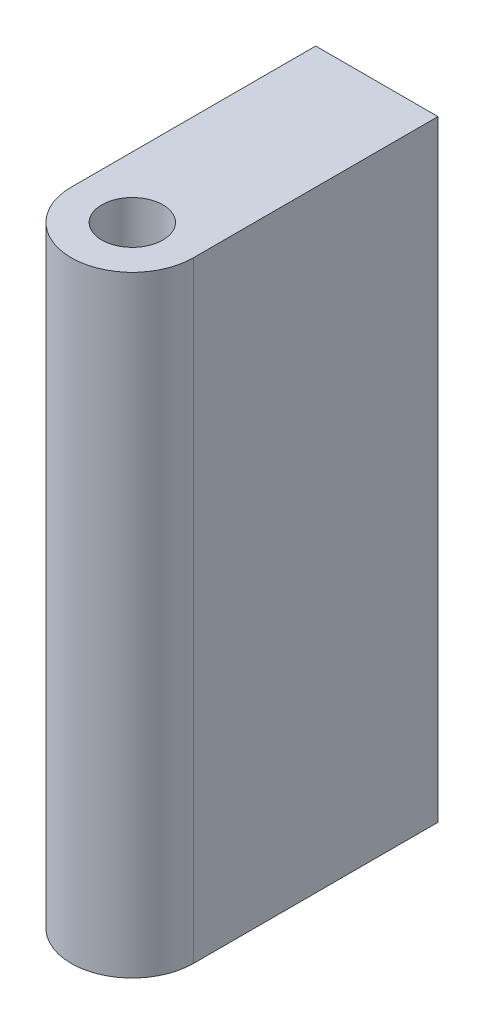
ISO-10303-21;
HEADER;
FILE_DESCRIPTION(('STEP AP214'),'2;1');
FILE_NAME('part.step','',(''),(''),'','','');
FILE_SCHEMA(('AUTOMOTIVE_DESIGN { 1 0 10303 214 1 1 1 1 }'));
ENDSEC;
DATA;
#1=APPLICATION_CONTEXT('core data for automotive mechanical design processes');
#2=APPLICATION_PROTOCOL_DEFINITION('international standard','automotive_design',2000,#1);
#3=PRODUCT_CONTEXT('',#1,'mechanical');
#4=PRODUCT('Part','Part','',(#3));
#5=PRODUCT_RELATED_PRODUCT_CATEGORY('part','',(#4));
#6=PRODUCT_DEFINITION_FORMATION('','',#4);
#7=PRODUCT_DEFINITION_CONTEXT('part definition',#1,'design');
#8=PRODUCT_DEFINITION('design','',#6,#7);
#9=PRODUCT_DEFINITION_SHAPE('','',#8);
#10=(LENGTH_UNIT() NAMED_UNIT(*) SI_UNIT(.MILLI.,.METRE.));
#11=(NAMED_UNIT(*) PLANE_ANGLE_UNIT() SI_UNIT($,.RADIAN.));
#12=(NAMED_UNIT(*) SI_UNIT($,.STERADIAN.) SOLID_ANGLE_UNIT());
#13=UNCERTAINTY_MEASURE_WITH_UNIT(LENGTH_MEASURE(1.E-05),#10,'distance_accuracy_value','');
#14=(GEOMETRIC_REPRESENTATION_CONTEXT(3) GLOBAL_UNCERTAINTY_ASSIGNED_CONTEXT((#13)) GLOBAL_UNIT_ASSIGNED_CONTEXT((#10,
#11,#12)) REPRESENTATION_CONTEXT('',''));
#15=CARTESIAN_POINT('',(0.,0.,0.));
#16=DIRECTION('',(0.,0.,1.));
#17=DIRECTION('',(1.,0.,0.));
#18=AXIS2_PLACEMENT_3D('',#15,#16,#17);
#19=CARTESIAN_POINT('',(0.5,-2.5,0.));
#20=DIRECTION('',(1.,0.,0.));
#21=DIRECTION('',(0.,0.,-1.));
#22=AXIS2_PLACEMENT_3D('',#19,#20,#21);
#23=PLANE('',#22);
#24=DIRECTION('',(0.,1.,0.));
#25=VECTOR('',#24,1.);
#26=CARTESIAN_POINT('',(0.5,-2.5,-2.));
#27=LINE('',#26,#25);
#28=CARTESIAN_POINT('',(0.5,-2.5,-2.));
#29=VERTEX_POINT('',#28);
#30=CARTESIAN_POINT('',(0.5,2.5,-2.));
#31=VERTEX_POINT('',#30);
#32=EDGE_CURVE('E39',#29,#31,#27,.T.);
#33=ORIENTED_EDGE('',*,*,#32,.T.);
#34=DIRECTION('',(0.,0.,-1.));
#35=VECTOR('',#34,1.);
#36=CARTESIAN_POINT('',(0.5,2.5,0.));
#37=LINE('',#36,#35);
#38=CARTESIAN_POINT('',(0.5,2.5,0.));
#39=VERTEX_POINT('',#38);
#40=EDGE_CURVE('E76',#39,#31,#37,.T.);
#41=ORIENTED_EDGE('',*,*,#40,.F.);
#42=DIRECTION('',(0.,1.,0.));
#43=VECTOR('',#42,1.);
#44=CARTESIAN_POINT('',(0.5,-2.5,0.));
#45=LINE('',#44,#43);
#46=CARTESIAN_POINT('',(0.5,-2.5,0.));
#47=VERTEX_POINT('',#46);
#48=EDGE_CURVE('E11',#47,#39,#45,.T.);
#49=ORIENTED_EDGE('',*,*,#48,.F.);
#50=DIRECTION('',(0.,0.,-1.));
#51=VECTOR('',#50,1.);
#52=CARTESIAN_POINT('',(0.5,-2.5,0.));
#53=LINE('',#52,#51);
#54=EDGE_CURVE('E77',#47,#29,#53,.T.);
#55=ORIENTED_EDGE('',*,*,#54,.T.);
#56=EDGE_LOOP('',(#33,#41,#49,#55));
#57=FACE_BOUND('',#56,.T.);
#58=ADVANCED_FACE('F36',(#57),#23,.T.);
#59=CARTESIAN_POINT('',(0.,-2.5,0.));
#60=DIRECTION('',(0.,1.,0.));
#61=DIRECTION('',(0.,0.,1.));
#62=AXIS2_PLACEMENT_3D('',#59,#60,#61);
#63=CYLINDRICAL_SURFACE('',#62,0.5);
#64=ORIENTED_EDGE('',*,*,#48,.T.);
#65=CARTESIAN_POINT('',(0.,2.5,0.));
#66=DIRECTION('',(0.,1.,0.));
#67=DIRECTION('',(0.,0.,1.));
#68=AXIS2_PLACEMENT_3D('',#65,#66,#67);
#69=CIRCLE('',#68,0.5);
#70=CARTESIAN_POINT('',(-0.5,2.5,0.));
#71=VERTEX_POINT('',#70);
#72=EDGE_CURVE('E94',#71,#39,#69,.T.);
#73=ORIENTED_EDGE('',*,*,#72,.F.);
#74=DIRECTION('',(0.,1.,0.));
#75=VECTOR('',#74,1.);
#76=CARTESIAN_POINT('',(-0.5,-2.5,0.));
#77=LINE('',#76,#75);
#78=CARTESIAN_POINT('',(-0.5,-2.5,0.));
#79=VERTEX_POINT('',#78);
#80=EDGE_CURVE('E44',#79,#71,#77,.T.);
#81=ORIENTED_EDGE('',*,*,#80,.F.);
#82=CARTESIAN_POINT('',(0.,-2.5,0.));
#83=DIRECTION('',(0.,1.,0.));
#84=DIRECTION('',(0.,0.,1.));
#85=AXIS2_PLACEMENT_3D('',#82,#83,#84);
#86=CIRCLE('',#85,0.5);
#87=EDGE_CURVE('E82',#79,#47,#86,.T.);
#88=ORIENTED_EDGE('',*,*,#87,.T.);
#89=EDGE_LOOP('',(#64,#73,#81,#88));
#90=FACE_BOUND('',#89,.T.);
#91=ADVANCED_FACE('F115',(#90),#63,.T.);
#92=CARTESIAN_POINT('',(-0.5,-2.5,0.));
#93=DIRECTION('',(-1.,0.,0.));
#94=DIRECTION('',(0.,0.,1.));
#95=AXIS2_PLACEMENT_3D('',#92,#93,#94);
#96=PLANE('',#95);
#97=ORIENTED_EDGE('',*,*,#80,.T.);
#98=DIRECTION('',(0.,0.,1.));
#99=VECTOR('',#98,1.);
#100=CARTESIAN_POINT('',(-0.5,2.5,0.));
#101=LINE('',#100,#99);
#102=CARTESIAN_POINT('',(-0.5,2.5,-2.));
#103=VERTEX_POINT('',#102);
#104=EDGE_CURVE('E89',#103,#71,#101,.T.);
#105=ORIENTED_EDGE('',*,*,#104,.F.);
#106=DIRECTION('',(0.,1.,0.));
#107=VECTOR('',#106,1.);
#108=CARTESIAN_POINT('',(-0.5,-2.5,-2.));
#109=LINE('',#108,#107);
#110=CARTESIAN_POINT('',(-0.5,-2.5,-2.));
#111=VERTEX_POINT('',#110);
#112=EDGE_CURVE('E81',#111,#103,#109,.T.);
#113=ORIENTED_EDGE('',*,*,#112,.F.);
#114=DIRECTION('',(0.,0.,1.));
#115=VECTOR('',#114,1.);
#116=CARTESIAN_POINT('',(-0.5,-2.5,0.));
#117=LINE('',#116,#115);
#118=EDGE_CURVE('E108',#111,#79,#117,.T.);
#119=ORIENTED_EDGE('',*,*,#118,.T.);
#120=EDGE_LOOP('',(#97,#105,#113,#119));
#121=FACE_BOUND('',#120,.T.);
#122=ADVANCED_FACE('F112',(#121),#96,.T.);
#123=CARTESIAN_POINT('',(-0.5,-2.5,-2.));
#124=DIRECTION('',(0.,0.,-1.));
#125=DIRECTION('',(-1.,0.,0.));
#126=AXIS2_PLACEMENT_3D('',#123,#124,#125);
#127=PLANE('',#126);
#128=ORIENTED_EDGE('',*,*,#112,.T.);
#129=DIRECTION('',(-1.,0.,0.));
#130=VECTOR('',#129,1.);
#131=CARTESIAN_POINT('',(-0.5,2.5,-2.));
#132=LINE('',#131,#130);
#133=EDGE_CURVE('E84',#31,#103,#132,.T.);
#134=ORIENTED_EDGE('',*,*,#133,.F.);
#135=ORIENTED_EDGE('',*,*,#32,.F.);
#136=DIRECTION('',(-1.,0.,0.));
#137=VECTOR('',#136,1.);
#138=CARTESIAN_POINT('',(-0.5,-2.5,-2.));
#139=LINE('',#138,#137);
#140=EDGE_CURVE('E106',#29,#111,#139,.T.);
#141=ORIENTED_EDGE('',*,*,#140,.T.);
#142=EDGE_LOOP('',(#128,#134,#135,#141));
#143=FACE_BOUND('',#142,.T.);
#144=ADVANCED_FACE('F85',(#143),#127,.T.);
#145=CARTESIAN_POINT('',(0.,-2.5,0.));
#146=DIRECTION('',(0.,1.,0.));
#147=DIRECTION('',(0.,0.,1.));
#148=AXIS2_PLACEMENT_3D('',#145,#146,#147);
#149=PLANE('',#148);
#150=CARTESIAN_POINT('',(0.,-2.5,0.));
#151=DIRECTION('',(0.,1.,0.));
#152=DIRECTION('',(0.,0.,1.));
#153=AXIS2_PLACEMENT_3D('',#150,#151,#152);
#154=CIRCLE('',#153,0.25);
#155=CARTESIAN_POINT('',(0.,-2.5,0.25));
#156=VERTEX_POINT('',#155);
#157=EDGE_CURVE('E102',#156,#156,#154,.T.);
#158=ORIENTED_EDGE('',*,*,#157,.T.);
#159=EDGE_LOOP('',(#158));
#160=FACE_BOUND('',#159,.T.);
#161=ORIENTED_EDGE('',*,*,#54,.F.);
#162=ORIENTED_EDGE('',*,*,#87,.F.);
#163=ORIENTED_EDGE('',*,*,#118,.F.);
#164=ORIENTED_EDGE('',*,*,#140,.F.);
#165=EDGE_LOOP('',(#161,#162,#163,#164));
#166=FACE_BOUND('',#165,.T.);
#167=ADVANCED_FACE('F117',(#160,#166),#149,.F.);
#168=CARTESIAN_POINT('',(0.,-2.5,0.));
#169=DIRECTION('',(0.,1.,0.));
#170=DIRECTION('',(0.,0.,1.));
#171=AXIS2_PLACEMENT_3D('',#168,#169,#170);
#172=CYLINDRICAL_SURFACE('',#171,0.25);
#173=ORIENTED_EDGE('',*,*,#157,.F.);
#174=EDGE_LOOP('',(#173));
#175=FACE_BOUND('',#174,.T.);
#176=CARTESIAN_POINT('',(0.,2.5,0.));
#177=DIRECTION('',(0.,1.,0.));
#178=DIRECTION('',(0.,0.,1.));
#179=AXIS2_PLACEMENT_3D('',#176,#177,#178);
#180=CIRCLE('',#179,0.25);
#181=CARTESIAN_POINT('',(0.,2.5,0.25));
#182=VERTEX_POINT('',#181);
#183=EDGE_CURVE('E95',#182,#182,#180,.T.);
#184=ORIENTED_EDGE('',*,*,#183,.T.);
#185=EDGE_LOOP('',(#184));
#186=FACE_BOUND('',#185,.T.);
#187=ADVANCED_FACE('F119',(#175,#186),#172,.F.);
#188=CARTESIAN_POINT('',(0.,2.5,0.));
#189=DIRECTION('',(0.,1.,0.));
#190=DIRECTION('',(0.,0.,1.));
#191=AXIS2_PLACEMENT_3D('',#188,#189,#190);
#192=PLANE('',#191);
#193=ORIENTED_EDGE('',*,*,#40,.T.);
#194=ORIENTED_EDGE('',*,*,#133,.T.);
#195=ORIENTED_EDGE('',*,*,#104,.T.);
#196=ORIENTED_EDGE('',*,*,#72,.T.);
#197=EDGE_LOOP('',(#193,#194,#195,#196));
#198=FACE_BOUND('',#197,.T.);
#199=ORIENTED_EDGE('',*,*,#183,.F.);
#200=EDGE_LOOP('',(#199));
#201=FACE_BOUND('',#200,.T.);
#202=ADVANCED_FACE('F92',(#198,#201),#192,.T.);
#203=CLOSED_SHELL('',(#58,#91,#122,#144,#167,#187,#202));
#204=MANIFOLD_SOLID_BREP('B2',#203);
#205=ADVANCED_BREP_SHAPE_REPRESENTATION('',(#18,#204),#14);
#206=SHAPE_DEFINITION_REPRESENTATION(#9,#205);
ENDSEC;
END-ISO-10303-21;
